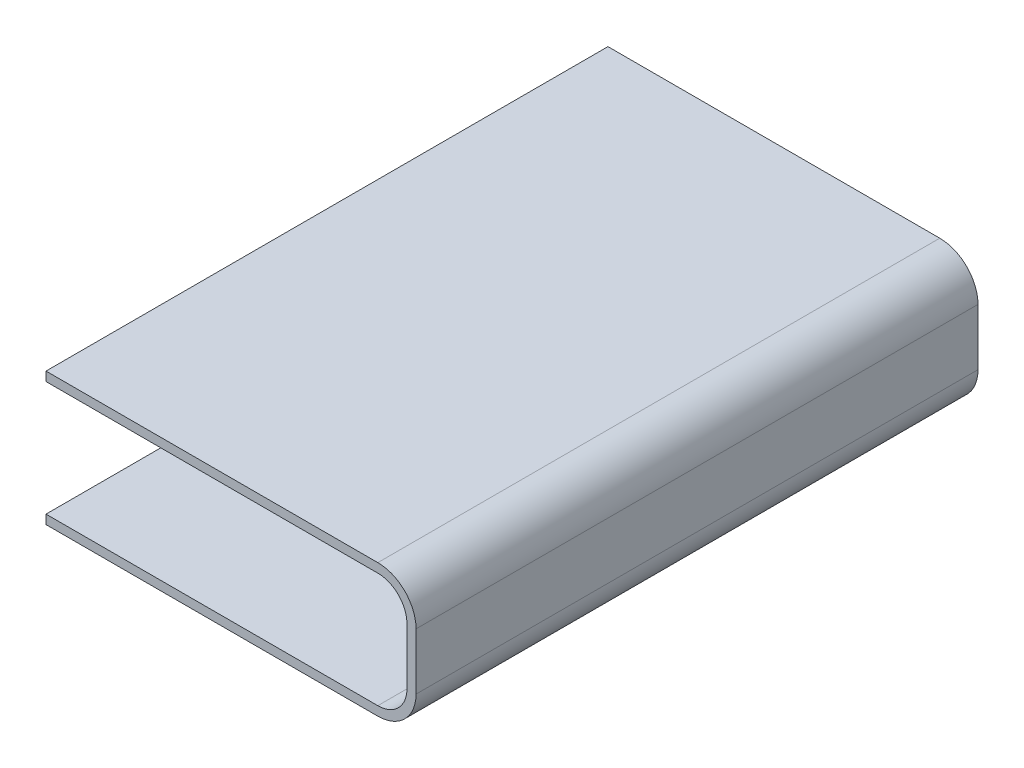
ISO-10303-21;
HEADER;
FILE_DESCRIPTION(('STEP AP214'),'2;1');
FILE_NAME('part.step','',(''),(''),'','','');
FILE_SCHEMA(('AUTOMOTIVE_DESIGN { 1 0 10303 214 1 1 1 1 }'));
ENDSEC;
DATA;
#1=APPLICATION_CONTEXT('core data for automotive mechanical design processes');
#2=APPLICATION_PROTOCOL_DEFINITION('international standard','automotive_design',2000,#1);
#3=PRODUCT_CONTEXT('',#1,'mechanical');
#4=PRODUCT('Part','Part','',(#3));
#5=PRODUCT_RELATED_PRODUCT_CATEGORY('part','',(#4));
#6=PRODUCT_DEFINITION_FORMATION('','',#4);
#7=PRODUCT_DEFINITION_CONTEXT('part definition',#1,'design');
#8=PRODUCT_DEFINITION('design','',#6,#7);
#9=PRODUCT_DEFINITION_SHAPE('','',#8);
#10=(LENGTH_UNIT() NAMED_UNIT(*) SI_UNIT(.MILLI.,.METRE.));
#11=(NAMED_UNIT(*) PLANE_ANGLE_UNIT() SI_UNIT($,.RADIAN.));
#12=(NAMED_UNIT(*) SI_UNIT($,.STERADIAN.) SOLID_ANGLE_UNIT());
#13=UNCERTAINTY_MEASURE_WITH_UNIT(LENGTH_MEASURE(1.E-05),#10,'distance_accuracy_value','');
#14=(GEOMETRIC_REPRESENTATION_CONTEXT(3) GLOBAL_UNCERTAINTY_ASSIGNED_CONTEXT((#13)) GLOBAL_UNIT_ASSIGNED_CONTEXT((#10,
#11,#12)) REPRESENTATION_CONTEXT('',''));
#15=CARTESIAN_POINT('',(0.,0.,0.));
#16=DIRECTION('',(0.,0.,1.));
#17=DIRECTION('',(1.,0.,0.));
#18=AXIS2_PLACEMENT_3D('',#15,#16,#17);
#19=CARTESIAN_POINT('',(-152.4,0.396875,152.4));
#20=DIRECTION('',(1.,0.,0.));
#21=DIRECTION('',(0.,0.,-1.));
#22=AXIS2_PLACEMENT_3D('',#19,#20,#21);
#23=PLANE('',#22);
#24=DIRECTION('',(0.,0.,-1.));
#25=VECTOR('',#24,1.);
#26=CARTESIAN_POINT('',(-152.4,0.396875,152.4));
#27=LINE('',#26,#25);
#28=CARTESIAN_POINT('',(-152.4,0.396875,152.4));
#29=VERTEX_POINT('',#28);
#30=CARTESIAN_POINT('',(-152.4,0.396875,103.4034));
#31=VERTEX_POINT('',#30);
#32=EDGE_CURVE('E47',#29,#31,#27,.T.);
#33=ORIENTED_EDGE('',*,*,#32,.T.);
#34=DIRECTION('',(0.,-1.,0.));
#35=VECTOR('',#34,1.);
#36=CARTESIAN_POINT('',(-152.4,0.396875,103.4034));
#37=LINE('',#36,#35);
#38=CARTESIAN_POINT('',(-152.4,-0.396875,103.4034));
#39=VERTEX_POINT('',#38);
#40=EDGE_CURVE('E198',#31,#39,#37,.T.);
#41=ORIENTED_EDGE('',*,*,#40,.T.);
#42=DIRECTION('',(0.,0.,-1.));
#43=VECTOR('',#42,1.);
#44=CARTESIAN_POINT('',(-152.4,-0.396875,152.4));
#45=LINE('',#44,#43);
#46=CARTESIAN_POINT('',(-152.4,-0.396875,152.4));
#47=VERTEX_POINT('',#46);
#48=EDGE_CURVE('E12',#47,#39,#45,.T.);
#49=ORIENTED_EDGE('',*,*,#48,.F.);
#50=DIRECTION('',(0.,-1.,0.));
#51=VECTOR('',#50,1.);
#52=CARTESIAN_POINT('',(-152.4,0.396875,152.4));
#53=LINE('',#52,#51);
#54=EDGE_CURVE('E201',#29,#47,#53,.T.);
#55=ORIENTED_EDGE('',*,*,#54,.F.);
#56=EDGE_LOOP('',(#33,#41,#49,#55));
#57=FACE_BOUND('',#56,.T.);
#58=ADVANCED_FACE('F40',(#57),#23,.F.);
#59=CARTESIAN_POINT('',(152.4,-0.396875,152.4));
#60=DIRECTION('',(0.,1.,0.));
#61=DIRECTION('',(0.,0.,1.));
#62=AXIS2_PLACEMENT_3D('',#59,#60,#61);
#63=PLANE('',#62);
#64=DIRECTION('',(-1.,0.,0.));
#65=VECTOR('',#64,1.);
#66=CARTESIAN_POINT('',(-152.4,-0.396875,103.4034));
#67=LINE('',#66,#65);
#68=CARTESIAN_POINT('',(-123.4694,-0.396875,103.4034));
#69=VERTEX_POINT('',#68);
#70=EDGE_CURVE('E192',#69,#39,#67,.T.);
#71=ORIENTED_EDGE('',*,*,#70,.F.);
#72=DIRECTION('',(0.,0.,-1.));
#73=VECTOR('',#72,1.);
#74=CARTESIAN_POINT('',(-123.4694,-0.396875,152.4));
#75=LINE('',#74,#73);
#76=CARTESIAN_POINT('',(-123.4694,-0.396874999999993,152.4));
#77=VERTEX_POINT('',#76);
#78=EDGE_CURVE('E175',#77,#69,#75,.T.);
#79=ORIENTED_EDGE('',*,*,#78,.F.);
#80=DIRECTION('',(1.,0.,0.));
#81=VECTOR('',#80,1.);
#82=CARTESIAN_POINT('',(152.4,-0.396875,152.4));
#83=LINE('',#82,#81);
#84=EDGE_CURVE('E203',#47,#77,#83,.T.);
#85=ORIENTED_EDGE('',*,*,#84,.F.);
#86=ORIENTED_EDGE('',*,*,#48,.T.);
#87=EDGE_LOOP('',(#71,#79,#85,#86));
#88=FACE_BOUND('',#87,.T.);
#89=ADVANCED_FACE('F215',(#88),#63,.F.);
#90=CARTESIAN_POINT('',(152.4,0.396875,152.4));
#91=DIRECTION('',(0.,-1.,0.));
#92=DIRECTION('',(0.,0.,-1.));
#93=AXIS2_PLACEMENT_3D('',#90,#91,#92);
#94=PLANE('',#93);
#95=DIRECTION('',(-1.,0.,0.));
#96=VECTOR('',#95,1.);
#97=CARTESIAN_POINT('',(152.4,0.396875,152.4));
#98=LINE('',#97,#96);
#99=CARTESIAN_POINT('',(-123.4694,0.396875,152.4));
#100=VERTEX_POINT('',#99);
#101=EDGE_CURVE('E54',#100,#29,#98,.T.);
#102=ORIENTED_EDGE('',*,*,#101,.F.);
#103=DIRECTION('',(0.,0.,-1.));
#104=VECTOR('',#103,1.);
#105=CARTESIAN_POINT('',(-123.4694,0.396875,152.4));
#106=LINE('',#105,#104);
#107=CARTESIAN_POINT('',(-123.4694,0.396875,103.4034));
#108=VERTEX_POINT('',#107);
#109=EDGE_CURVE('E149',#100,#108,#106,.T.);
#110=ORIENTED_EDGE('',*,*,#109,.T.);
#111=DIRECTION('',(-1.,0.,0.));
#112=VECTOR('',#111,1.);
#113=CARTESIAN_POINT('',(-152.4,0.396875,103.4034));
#114=LINE('',#113,#112);
#115=EDGE_CURVE('E195',#108,#31,#114,.T.);
#116=ORIENTED_EDGE('',*,*,#115,.T.);
#117=ORIENTED_EDGE('',*,*,#32,.F.);
#118=EDGE_LOOP('',(#102,#110,#116,#117));
#119=FACE_BOUND('',#118,.T.);
#120=ADVANCED_FACE('F209',(#119),#94,.F.);
#121=CARTESIAN_POINT('',(0.,0.,152.4));
#122=DIRECTION('',(0.,0.,-1.));
#123=DIRECTION('',(-1.,0.,0.));
#124=AXIS2_PLACEMENT_3D('',#121,#122,#123);
#125=PLANE('',#124);
#126=ORIENTED_EDGE('',*,*,#84,.T.);
#127=CARTESIAN_POINT('',(-123.4694,-2.936875,152.4));
#128=DIRECTION('',(0.,0.,-1.));
#129=DIRECTION('',(-1.,0.,0.));
#130=AXIS2_PLACEMENT_3D('',#127,#128,#129);
#131=CIRCLE('',#130,2.54000000000001);
#132=CARTESIAN_POINT('',(-120.9294,-2.936875,152.4));
#133=VERTEX_POINT('',#132);
#134=EDGE_CURVE('E153',#77,#133,#131,.T.);
#135=ORIENTED_EDGE('',*,*,#134,.T.);
#136=DIRECTION('',(0.,-1.,0.));
#137=VECTOR('',#136,1.);
#138=CARTESIAN_POINT('',(-120.9294,-7.864475,152.4));
#139=LINE('',#138,#137);
#140=CARTESIAN_POINT('',(-120.9294,-7.864475,152.4));
#141=VERTEX_POINT('',#140);
#142=EDGE_CURVE('E221',#133,#141,#139,.T.);
#143=ORIENTED_EDGE('',*,*,#142,.T.);
#144=CARTESIAN_POINT('',(-123.4694,-7.864475,152.4));
#145=DIRECTION('',(0.,0.,-1.));
#146=DIRECTION('',(-1.,0.,0.));
#147=AXIS2_PLACEMENT_3D('',#144,#145,#146);
#148=CIRCLE('',#147,2.53999999999999);
#149=CARTESIAN_POINT('',(-123.4694,-10.404475,152.4));
#150=VERTEX_POINT('',#149);
#151=EDGE_CURVE('E228',#141,#150,#148,.T.);
#152=ORIENTED_EDGE('',*,*,#151,.T.);
#153=DIRECTION('',(-1.,0.,0.));
#154=VECTOR('',#153,1.);
#155=CARTESIAN_POINT('',(-152.4,-10.404475,152.4));
#156=LINE('',#155,#154);
#157=CARTESIAN_POINT('',(-152.4,-10.404475,152.4));
#158=VERTEX_POINT('',#157);
#159=EDGE_CURVE('E229',#150,#158,#156,.T.);
#160=ORIENTED_EDGE('',*,*,#159,.T.);
#161=DIRECTION('',(0.,-1.,0.));
#162=VECTOR('',#161,1.);
#163=CARTESIAN_POINT('',(-152.4,-11.198225,152.4));
#164=LINE('',#163,#162);
#165=CARTESIAN_POINT('',(-152.4,-11.198225,152.4));
#166=VERTEX_POINT('',#165);
#167=EDGE_CURVE('E234',#158,#166,#164,.T.);
#168=ORIENTED_EDGE('',*,*,#167,.T.);
#169=DIRECTION('',(-1.,0.,0.));
#170=VECTOR('',#169,1.);
#171=CARTESIAN_POINT('',(-152.4,-11.198225,152.4));
#172=LINE('',#171,#170);
#173=CARTESIAN_POINT('',(-123.4694,-11.198225,152.4));
#174=VERTEX_POINT('',#173);
#175=EDGE_CURVE('E237',#174,#166,#172,.T.);
#176=ORIENTED_EDGE('',*,*,#175,.F.);
#177=CARTESIAN_POINT('',(-123.4694,-7.864475,152.4));
#178=DIRECTION('',(0.,0.,-1.));
#179=DIRECTION('',(-1.,0.,0.));
#180=AXIS2_PLACEMENT_3D('',#177,#178,#179);
#181=CIRCLE('',#180,3.33374999999999);
#182=CARTESIAN_POINT('',(-120.13565,-7.86447500000001,152.4));
#183=VERTEX_POINT('',#182);
#184=EDGE_CURVE('E146',#183,#174,#181,.T.);
#185=ORIENTED_EDGE('',*,*,#184,.F.);
#186=DIRECTION('',(0.,-1.,0.));
#187=VECTOR('',#186,1.);
#188=CARTESIAN_POINT('',(-120.13565,-7.86447500000001,152.4));
#189=LINE('',#188,#187);
#190=CARTESIAN_POINT('',(-120.13565,-2.936875,152.4));
#191=VERTEX_POINT('',#190);
#192=EDGE_CURVE('E133',#191,#183,#189,.T.);
#193=ORIENTED_EDGE('',*,*,#192,.F.);
#194=CARTESIAN_POINT('',(-123.4694,-2.936875,152.4));
#195=DIRECTION('',(0.,0.,-1.));
#196=DIRECTION('',(-1.,0.,0.));
#197=AXIS2_PLACEMENT_3D('',#194,#195,#196);
#198=CIRCLE('',#197,3.33375000000001);
#199=EDGE_CURVE('E143',#100,#191,#198,.T.);
#200=ORIENTED_EDGE('',*,*,#199,.F.);
#201=ORIENTED_EDGE('',*,*,#101,.T.);
#202=ORIENTED_EDGE('',*,*,#54,.T.);
#203=EDGE_LOOP('',(#126,#135,#143,#152,#160,#168,#176,#185,#193,#200,#201,#202));
#204=FACE_BOUND('',#203,.T.);
#205=ADVANCED_FACE('F142',(#204),#125,.F.);
#206=CARTESIAN_POINT('',(-152.4,0.396875,103.4034));
#207=DIRECTION('',(0.,0.,1.));
#208=DIRECTION('',(1.,0.,0.));
#209=AXIS2_PLACEMENT_3D('',#206,#207,#208);
#210=PLANE('',#209);
#211=ORIENTED_EDGE('',*,*,#40,.F.);
#212=ORIENTED_EDGE('',*,*,#115,.F.);
#213=CARTESIAN_POINT('',(-123.4694,-2.936875,103.4034));
#214=DIRECTION('',(0.,0.,1.));
#215=DIRECTION('',(1.,0.,0.));
#216=AXIS2_PLACEMENT_3D('',#213,#214,#215);
#217=CIRCLE('',#216,3.33375000000001);
#218=CARTESIAN_POINT('',(-120.13565,-2.936875,103.4034));
#219=VERTEX_POINT('',#218);
#220=EDGE_CURVE('E174',#108,#219,#217,.F.);
#221=ORIENTED_EDGE('',*,*,#220,.T.);
#222=DIRECTION('',(0.,-1.,0.));
#223=VECTOR('',#222,1.);
#224=CARTESIAN_POINT('',(-120.13565,-7.86447500000001,103.4034));
#225=LINE('',#224,#223);
#226=CARTESIAN_POINT('',(-120.13565,-7.864475,103.4034));
#227=VERTEX_POINT('',#226);
#228=EDGE_CURVE('E134',#219,#227,#225,.T.);
#229=ORIENTED_EDGE('',*,*,#228,.T.);
#230=CARTESIAN_POINT('',(-123.4694,-7.864475,103.4034));
#231=DIRECTION('',(0.,0.,1.));
#232=DIRECTION('',(1.,0.,0.));
#233=AXIS2_PLACEMENT_3D('',#230,#231,#232);
#234=CIRCLE('',#233,3.33374999999999);
#235=CARTESIAN_POINT('',(-123.4694,-11.198225,103.4034));
#236=VERTEX_POINT('',#235);
#237=EDGE_CURVE('E171',#227,#236,#234,.F.);
#238=ORIENTED_EDGE('',*,*,#237,.T.);
#239=DIRECTION('',(-1.,0.,0.));
#240=VECTOR('',#239,1.);
#241=CARTESIAN_POINT('',(-152.4,-11.198225,103.4034));
#242=LINE('',#241,#240);
#243=CARTESIAN_POINT('',(-152.4,-11.198225,103.4034));
#244=VERTEX_POINT('',#243);
#245=EDGE_CURVE('E169',#236,#244,#242,.T.);
#246=ORIENTED_EDGE('',*,*,#245,.T.);
#247=DIRECTION('',(0.,-1.,0.));
#248=VECTOR('',#247,1.);
#249=CARTESIAN_POINT('',(-152.4,-11.198225,103.4034));
#250=LINE('',#249,#248);
#251=CARTESIAN_POINT('',(-152.4,-10.404475,103.4034));
#252=VERTEX_POINT('',#251);
#253=EDGE_CURVE('E166',#252,#244,#250,.T.);
#254=ORIENTED_EDGE('',*,*,#253,.F.);
#255=DIRECTION('',(-1.,0.,0.));
#256=VECTOR('',#255,1.);
#257=CARTESIAN_POINT('',(-152.4,-10.404475,103.4034));
#258=LINE('',#257,#256);
#259=CARTESIAN_POINT('',(-123.4694,-10.404475,103.4034));
#260=VERTEX_POINT('',#259);
#261=EDGE_CURVE('E163',#260,#252,#258,.T.);
#262=ORIENTED_EDGE('',*,*,#261,.F.);
#263=CARTESIAN_POINT('',(-123.4694,-7.864475,103.4034));
#264=DIRECTION('',(0.,0.,1.));
#265=DIRECTION('',(1.,0.,0.));
#266=AXIS2_PLACEMENT_3D('',#263,#264,#265);
#267=CIRCLE('',#266,2.53999999999999);
#268=CARTESIAN_POINT('',(-120.9294,-7.864475,103.4034));
#269=VERTEX_POINT('',#268);
#270=EDGE_CURVE('E160',#269,#260,#267,.F.);
#271=ORIENTED_EDGE('',*,*,#270,.F.);
#272=DIRECTION('',(0.,-1.,0.));
#273=VECTOR('',#272,1.);
#274=CARTESIAN_POINT('',(-120.9294,-7.864475,103.4034));
#275=LINE('',#274,#273);
#276=CARTESIAN_POINT('',(-120.9294,-2.936875,103.4034));
#277=VERTEX_POINT('',#276);
#278=EDGE_CURVE('E157',#277,#269,#275,.T.);
#279=ORIENTED_EDGE('',*,*,#278,.F.);
#280=CARTESIAN_POINT('',(-123.4694,-2.936875,103.4034));
#281=DIRECTION('',(0.,0.,1.));
#282=DIRECTION('',(1.,0.,0.));
#283=AXIS2_PLACEMENT_3D('',#280,#281,#282);
#284=CIRCLE('',#283,2.54000000000001);
#285=EDGE_CURVE('E138',#69,#277,#284,.F.);
#286=ORIENTED_EDGE('',*,*,#285,.F.);
#287=ORIENTED_EDGE('',*,*,#70,.T.);
#288=EDGE_LOOP('',(#211,#212,#221,#229,#238,#246,#254,#262,#271,#279,#286,#287));
#289=FACE_BOUND('',#288,.T.);
#290=ADVANCED_FACE('F211',(#289),#210,.F.);
#291=CARTESIAN_POINT('',(-123.4694,-2.936875,69.1187879279275));
#292=DIRECTION('',(0.,0.,1.));
#293=DIRECTION('',(1.,0.,0.));
#294=AXIS2_PLACEMENT_3D('',#291,#292,#293);
#295=CYLINDRICAL_SURFACE('',#294,2.54000000000001);
#296=ORIENTED_EDGE('',*,*,#78,.T.);
#297=ORIENTED_EDGE('',*,*,#285,.T.);
#298=DIRECTION('',(0.,0.,1.));
#299=VECTOR('',#298,1.);
#300=CARTESIAN_POINT('',(-120.9294,-2.936875,69.1187879279275));
#301=LINE('',#300,#299);
#302=EDGE_CURVE('E188',#277,#133,#301,.T.);
#303=ORIENTED_EDGE('',*,*,#302,.T.);
#304=ORIENTED_EDGE('',*,*,#134,.F.);
#305=EDGE_LOOP('',(#296,#297,#303,#304));
#306=FACE_BOUND('',#305,.T.);
#307=ADVANCED_FACE('F265',(#306),#295,.F.);
#308=CARTESIAN_POINT('',(-120.9294,-7.864475,69.1187879279275));
#309=DIRECTION('',(1.,0.,0.));
#310=DIRECTION('',(0.,1.,0.));
#311=AXIS2_PLACEMENT_3D('',#308,#309,#310);
#312=PLANE('',#311);
#313=ORIENTED_EDGE('',*,*,#302,.F.);
#314=ORIENTED_EDGE('',*,*,#278,.T.);
#315=DIRECTION('',(0.,0.,1.));
#316=VECTOR('',#315,1.);
#317=CARTESIAN_POINT('',(-120.9294,-7.864475,69.1187879279275));
#318=LINE('',#317,#316);
#319=EDGE_CURVE('E186',#269,#141,#318,.T.);
#320=ORIENTED_EDGE('',*,*,#319,.T.);
#321=ORIENTED_EDGE('',*,*,#142,.F.);
#322=EDGE_LOOP('',(#313,#314,#320,#321));
#323=FACE_BOUND('',#322,.T.);
#324=ADVANCED_FACE('F226',(#323),#312,.F.);
#325=CARTESIAN_POINT('',(-123.4694,-7.864475,69.1187879279275));
#326=DIRECTION('',(0.,0.,1.));
#327=DIRECTION('',(1.,0.,0.));
#328=AXIS2_PLACEMENT_3D('',#325,#326,#327);
#329=CYLINDRICAL_SURFACE('',#328,2.53999999999999);
#330=ORIENTED_EDGE('',*,*,#319,.F.);
#331=ORIENTED_EDGE('',*,*,#270,.T.);
#332=DIRECTION('',(0.,0.,1.));
#333=VECTOR('',#332,1.);
#334=CARTESIAN_POINT('',(-123.4694,-10.404475,69.1187879279275));
#335=LINE('',#334,#333);
#336=EDGE_CURVE('E184',#260,#150,#335,.T.);
#337=ORIENTED_EDGE('',*,*,#336,.T.);
#338=ORIENTED_EDGE('',*,*,#151,.F.);
#339=EDGE_LOOP('',(#330,#331,#337,#338));
#340=FACE_BOUND('',#339,.T.);
#341=ADVANCED_FACE('F257',(#340),#329,.F.);
#342=CARTESIAN_POINT('',(-152.4,-10.404475,69.1187879279275));
#343=DIRECTION('',(0.,-1.,0.));
#344=DIRECTION('',(1.,0.,0.));
#345=AXIS2_PLACEMENT_3D('',#342,#343,#344);
#346=PLANE('',#345);
#347=ORIENTED_EDGE('',*,*,#336,.F.);
#348=ORIENTED_EDGE('',*,*,#261,.T.);
#349=DIRECTION('',(0.,0.,1.));
#350=VECTOR('',#349,1.);
#351=CARTESIAN_POINT('',(-152.4,-10.404475,69.1187879279275));
#352=LINE('',#351,#350);
#353=EDGE_CURVE('E182',#252,#158,#352,.T.);
#354=ORIENTED_EDGE('',*,*,#353,.T.);
#355=ORIENTED_EDGE('',*,*,#159,.F.);
#356=EDGE_LOOP('',(#347,#348,#354,#355));
#357=FACE_BOUND('',#356,.T.);
#358=ADVANCED_FACE('F255',(#357),#346,.F.);
#359=CARTESIAN_POINT('',(-152.4,-11.198225,69.1187879279275));
#360=DIRECTION('',(1.,0.,0.));
#361=DIRECTION('',(0.,0.,-1.));
#362=AXIS2_PLACEMENT_3D('',#359,#360,#361);
#363=PLANE('',#362);
#364=ORIENTED_EDGE('',*,*,#353,.F.);
#365=ORIENTED_EDGE('',*,*,#253,.T.);
#366=DIRECTION('',(0.,0.,1.));
#367=VECTOR('',#366,1.);
#368=CARTESIAN_POINT('',(-152.4,-11.198225,69.1187879279275));
#369=LINE('',#368,#367);
#370=EDGE_CURVE('E180',#244,#166,#369,.T.);
#371=ORIENTED_EDGE('',*,*,#370,.T.);
#372=ORIENTED_EDGE('',*,*,#167,.F.);
#373=EDGE_LOOP('',(#364,#365,#371,#372));
#374=FACE_BOUND('',#373,.T.);
#375=ADVANCED_FACE('F251',(#374),#363,.F.);
#376=CARTESIAN_POINT('',(-152.4,-11.198225,69.1187879279275));
#377=DIRECTION('',(0.,-1.,0.));
#378=DIRECTION('',(1.,0.,0.));
#379=AXIS2_PLACEMENT_3D('',#376,#377,#378);
#380=PLANE('',#379);
#381=ORIENTED_EDGE('',*,*,#245,.F.);
#382=DIRECTION('',(0.,0.,1.));
#383=VECTOR('',#382,1.);
#384=CARTESIAN_POINT('',(-123.4694,-11.198225,69.1187879279275));
#385=LINE('',#384,#383);
#386=EDGE_CURVE('E178',#236,#174,#385,.T.);
#387=ORIENTED_EDGE('',*,*,#386,.T.);
#388=ORIENTED_EDGE('',*,*,#175,.T.);
#389=ORIENTED_EDGE('',*,*,#370,.F.);
#390=EDGE_LOOP('',(#381,#387,#388,#389));
#391=FACE_BOUND('',#390,.T.);
#392=ADVANCED_FACE('F248',(#391),#380,.T.);
#393=CARTESIAN_POINT('',(-123.4694,-7.864475,69.1187879279275));
#394=DIRECTION('',(0.,0.,1.));
#395=DIRECTION('',(1.,0.,0.));
#396=AXIS2_PLACEMENT_3D('',#393,#394,#395);
#397=CYLINDRICAL_SURFACE('',#396,3.33374999999999);
#398=ORIENTED_EDGE('',*,*,#237,.F.);
#399=DIRECTION('',(0.,0.,1.));
#400=VECTOR('',#399,1.);
#401=CARTESIAN_POINT('',(-120.13565,-7.86447500000001,69.1187879279275));
#402=LINE('',#401,#400);
#403=EDGE_CURVE('E139',#227,#183,#402,.T.);
#404=ORIENTED_EDGE('',*,*,#403,.T.);
#405=ORIENTED_EDGE('',*,*,#184,.T.);
#406=ORIENTED_EDGE('',*,*,#386,.F.);
#407=EDGE_LOOP('',(#398,#404,#405,#406));
#408=FACE_BOUND('',#407,.T.);
#409=ADVANCED_FACE('F243',(#408),#397,.T.);
#410=CARTESIAN_POINT('',(-120.13565,-7.86447500000001,69.1187879279275));
#411=DIRECTION('',(1.,0.,0.));
#412=DIRECTION('',(0.,1.,0.));
#413=AXIS2_PLACEMENT_3D('',#410,#411,#412);
#414=PLANE('',#413);
#415=ORIENTED_EDGE('',*,*,#228,.F.);
#416=DIRECTION('',(0.,0.,1.));
#417=VECTOR('',#416,1.);
#418=CARTESIAN_POINT('',(-120.13565,-2.936875,69.1187879279275));
#419=LINE('',#418,#417);
#420=EDGE_CURVE('E129',#219,#191,#419,.T.);
#421=ORIENTED_EDGE('',*,*,#420,.T.);
#422=ORIENTED_EDGE('',*,*,#192,.T.);
#423=ORIENTED_EDGE('',*,*,#403,.F.);
#424=EDGE_LOOP('',(#415,#421,#422,#423));
#425=FACE_BOUND('',#424,.T.);
#426=ADVANCED_FACE('F131',(#425),#414,.T.);
#427=CARTESIAN_POINT('',(-123.4694,-2.936875,69.1187879279275));
#428=DIRECTION('',(0.,0.,1.));
#429=DIRECTION('',(1.,0.,0.));
#430=AXIS2_PLACEMENT_3D('',#427,#428,#429);
#431=CYLINDRICAL_SURFACE('',#430,3.33375000000001);
#432=ORIENTED_EDGE('',*,*,#220,.F.);
#433=ORIENTED_EDGE('',*,*,#109,.F.);
#434=ORIENTED_EDGE('',*,*,#199,.T.);
#435=ORIENTED_EDGE('',*,*,#420,.F.);
#436=EDGE_LOOP('',(#432,#433,#434,#435));
#437=FACE_BOUND('',#436,.T.);
#438=ADVANCED_FACE('F148',(#437),#431,.T.);
#439=CLOSED_SHELL('',(#58,#89,#120,#205,#290,#307,#324,#341,#358,#375,#392,#409,#426,#438));
#440=MANIFOLD_SOLID_BREP('B2',#439);
#441=ADVANCED_BREP_SHAPE_REPRESENTATION('',(#18,#440),#14);
#442=SHAPE_DEFINITION_REPRESENTATION(#9,#441);
ENDSEC;
END-ISO-10303-21;
